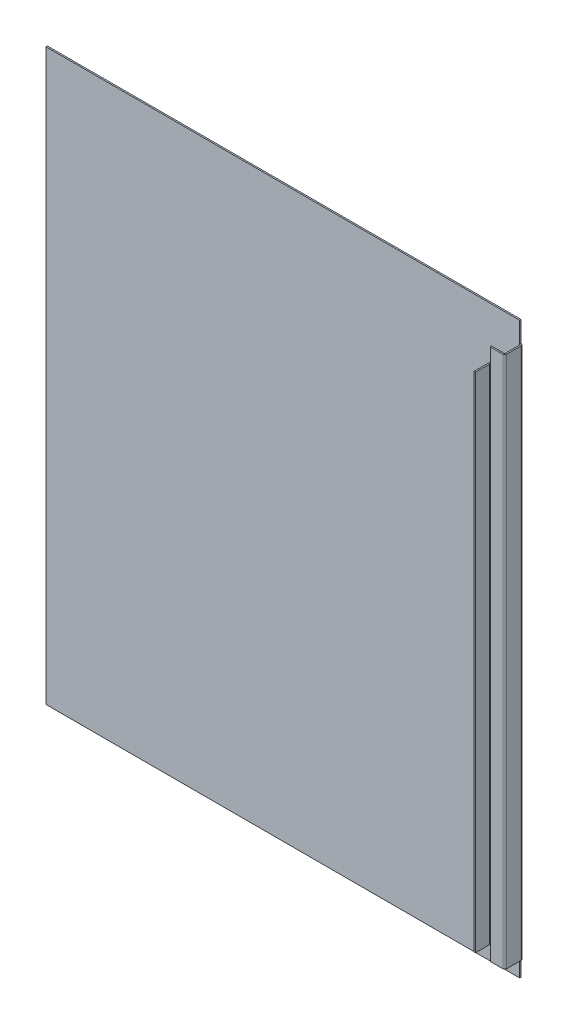
ISO-10303-21;
HEADER;
FILE_DESCRIPTION(('STEP AP214'),'2;1');
FILE_NAME('part.step','',(''),(''),'','','');
FILE_SCHEMA(('AUTOMOTIVE_DESIGN { 1 0 10303 214 1 1 1 1 }'));
ENDSEC;
DATA;
#1=APPLICATION_CONTEXT('core data for automotive mechanical design processes');
#2=APPLICATION_PROTOCOL_DEFINITION('international standard','automotive_design',2000,#1);
#3=PRODUCT_CONTEXT('',#1,'mechanical');
#4=PRODUCT('Part','Part','',(#3));
#5=PRODUCT_RELATED_PRODUCT_CATEGORY('part','',(#4));
#6=PRODUCT_DEFINITION_FORMATION('','',#4);
#7=PRODUCT_DEFINITION_CONTEXT('part definition',#1,'design');
#8=PRODUCT_DEFINITION('design','',#6,#7);
#9=PRODUCT_DEFINITION_SHAPE('','',#8);
#10=(LENGTH_UNIT() NAMED_UNIT(*) SI_UNIT(.MILLI.,.METRE.));
#11=(NAMED_UNIT(*) PLANE_ANGLE_UNIT() SI_UNIT($,.RADIAN.));
#12=(NAMED_UNIT(*) SI_UNIT($,.STERADIAN.) SOLID_ANGLE_UNIT());
#13=UNCERTAINTY_MEASURE_WITH_UNIT(LENGTH_MEASURE(1.E-05),#10,'distance_accuracy_value','');
#14=(GEOMETRIC_REPRESENTATION_CONTEXT(3) GLOBAL_UNCERTAINTY_ASSIGNED_CONTEXT((#13)) GLOBAL_UNIT_ASSIGNED_CONTEXT((#10,
#11,#12)) REPRESENTATION_CONTEXT('',''));
#15=CARTESIAN_POINT('',(0.,0.,0.));
#16=DIRECTION('',(0.,0.,1.));
#17=DIRECTION('',(1.,0.,0.));
#18=AXIS2_PLACEMENT_3D('',#15,#16,#17);
#19=CARTESIAN_POINT('',(302.15,776.2,25.));
#20=DIRECTION('',(1.,0.,0.));
#21=DIRECTION('',(0.,0.,-1.));
#22=AXIS2_PLACEMENT_3D('',#19,#20,#21);
#23=PLANE('',#22);
#24=DIRECTION('',(0.,0.,1.));
#25=VECTOR('',#24,1.);
#26=CARTESIAN_POINT('',(302.15,727.8,35.3683));
#27=LINE('',#26,#25);
#28=CARTESIAN_POINT('',(302.15,727.8,25.7366));
#29=VERTEX_POINT('',#28);
#30=CARTESIAN_POINT('',(302.15,727.8,45.));
#31=VERTEX_POINT('',#30);
#32=EDGE_CURVE('E199',#29,#31,#27,.T.);
#33=ORIENTED_EDGE('',*,*,#32,.F.);
#34=DIRECTION('',(0.,-1.,0.));
#35=VECTOR('',#34,1.);
#36=CARTESIAN_POINT('',(302.15,776.2,25.7366));
#37=LINE('',#36,#35);
#38=CARTESIAN_POINT('',(302.15,42.5,25.7366));
#39=VERTEX_POINT('',#38);
#40=EDGE_CURVE('E253',#29,#39,#37,.T.);
#41=ORIENTED_EDGE('',*,*,#40,.T.);
#42=DIRECTION('',(0.,0.,1.));
#43=VECTOR('',#42,1.);
#44=CARTESIAN_POINT('',(302.15,42.5,22.3634));
#45=LINE('',#44,#43);
#46=CARTESIAN_POINT('',(302.15,42.5,45.));
#47=VERTEX_POINT('',#46);
#48=EDGE_CURVE('E815',#39,#47,#45,.T.);
#49=ORIENTED_EDGE('',*,*,#48,.T.);
#50=DIRECTION('',(0.,-1.,0.));
#51=VECTOR('',#50,1.);
#52=CARTESIAN_POINT('',(302.15,776.2,45.));
#53=LINE('',#52,#51);
#54=EDGE_CURVE('E218',#31,#47,#53,.T.);
#55=ORIENTED_EDGE('',*,*,#54,.F.);
#56=EDGE_LOOP('',(#33,#41,#49,#55));
#57=FACE_BOUND('',#56,.T.);
#58=ADVANCED_FACE('F43',(#57),#23,.F.);
#59=CARTESIAN_POINT('',(304.05,776.2,45.));
#60=DIRECTION('',(0.,0.,1.));
#61=DIRECTION('',(1.,0.,0.));
#62=AXIS2_PLACEMENT_3D('',#59,#60,#61);
#63=PLANE('',#62);
#64=DIRECTION('',(0.,-1.,0.));
#65=VECTOR('',#64,1.);
#66=CARTESIAN_POINT('',(304.05,776.2,45.));
#67=LINE('',#66,#65);
#68=CARTESIAN_POINT('',(304.05,727.8,45.));
#69=VERTEX_POINT('',#68);
#70=CARTESIAN_POINT('',(304.05,42.5,45.));
#71=VERTEX_POINT('',#70);
#72=EDGE_CURVE('E211',#69,#71,#67,.T.);
#73=ORIENTED_EDGE('',*,*,#72,.F.);
#74=DIRECTION('',(-1.,0.,0.));
#75=VECTOR('',#74,1.);
#76=CARTESIAN_POINT('',(304.05,727.8,45.));
#77=LINE('',#76,#75);
#78=EDGE_CURVE('E193',#31,#69,#77,.F.);
#79=ORIENTED_EDGE('',*,*,#78,.F.);
#80=ORIENTED_EDGE('',*,*,#54,.T.);
#81=DIRECTION('',(1.,0.,0.));
#82=VECTOR('',#81,1.);
#83=CARTESIAN_POINT('',(302.15,42.5,45.));
#84=LINE('',#83,#82);
#85=EDGE_CURVE('E217',#71,#47,#84,.F.);
#86=ORIENTED_EDGE('',*,*,#85,.F.);
#87=EDGE_LOOP('',(#73,#79,#80,#86));
#88=FACE_BOUND('',#87,.T.);
#89=ADVANCED_FACE('F216',(#88),#63,.T.);
#90=CARTESIAN_POINT('',(304.05,776.2,25.));
#91=DIRECTION('',(1.,0.,0.));
#92=DIRECTION('',(0.,0.,-1.));
#93=AXIS2_PLACEMENT_3D('',#90,#91,#92);
#94=PLANE('',#93);
#95=DIRECTION('',(0.,-1.,0.));
#96=VECTOR('',#95,1.);
#97=CARTESIAN_POINT('',(304.05,776.2,25.7366));
#98=LINE('',#97,#96);
#99=CARTESIAN_POINT('',(304.05,727.8,25.7366));
#100=VERTEX_POINT('',#99);
#101=CARTESIAN_POINT('',(304.05,42.5,25.7366));
#102=VERTEX_POINT('',#101);
#103=EDGE_CURVE('E213',#100,#102,#98,.T.);
#104=ORIENTED_EDGE('',*,*,#103,.F.);
#105=DIRECTION('',(0.,0.,1.));
#106=VECTOR('',#105,1.);
#107=CARTESIAN_POINT('',(304.05,727.8,25.));
#108=LINE('',#107,#106);
#109=EDGE_CURVE('E196',#100,#69,#108,.T.);
#110=ORIENTED_EDGE('',*,*,#109,.T.);
#111=ORIENTED_EDGE('',*,*,#72,.T.);
#112=DIRECTION('',(0.,0.,-1.));
#113=VECTOR('',#112,1.);
#114=CARTESIAN_POINT('',(304.05,42.5,35.3683));
#115=LINE('',#114,#113);
#116=EDGE_CURVE('E439',#102,#71,#115,.F.);
#117=ORIENTED_EDGE('',*,*,#116,.F.);
#118=EDGE_LOOP('',(#104,#110,#111,#117));
#119=FACE_BOUND('',#118,.T.);
#120=ADVANCED_FACE('F209',(#119),#94,.T.);
#121=CARTESIAN_POINT('',(304.7866,776.2,25.7366));
#122=DIRECTION('',(0.,-1.,0.));
#123=DIRECTION('',(0.,0.,-1.));
#124=AXIS2_PLACEMENT_3D('',#121,#122,#123);
#125=CYLINDRICAL_SURFACE('',#124,0.7366);
#126=DIRECTION('',(0.,-1.,0.));
#127=VECTOR('',#126,1.);
#128=CARTESIAN_POINT('',(304.580812409922,776.2,25.0293298763769));
#129=LINE('',#128,#127);
#130=CARTESIAN_POINT('',(304.580812409922,747.8,25.0293298763769));
#131=VERTEX_POINT('',#130);
#132=CARTESIAN_POINT('',(304.580812409922,727.8,25.0293298763769));
#133=VERTEX_POINT('',#132);
#134=EDGE_CURVE('E58',#131,#133,#129,.T.);
#135=ORIENTED_EDGE('',*,*,#134,.T.);
#136=CARTESIAN_POINT('',(304.7866,727.8,25.7366));
#137=DIRECTION('',(0.,-1.,0.));
#138=DIRECTION('',(0.,0.,-1.));
#139=AXIS2_PLACEMENT_3D('',#136,#137,#138);
#140=CIRCLE('',#139,0.7366);
#141=EDGE_CURVE('E441',#100,#133,#140,.T.);
#142=ORIENTED_EDGE('',*,*,#141,.F.);
#143=ORIENTED_EDGE('',*,*,#103,.T.);
#144=CARTESIAN_POINT('',(304.7866,42.5,25.7366));
#145=DIRECTION('',(0.,-1.,0.));
#146=DIRECTION('',(0.,0.,-1.));
#147=AXIS2_PLACEMENT_3D('',#144,#145,#146);
#148=CIRCLE('',#147,0.7366);
#149=CARTESIAN_POINT('',(304.580812409922,42.5,25.0293298763769));
#150=VERTEX_POINT('',#149);
#151=EDGE_CURVE('E443',#150,#102,#148,.F.);
#152=ORIENTED_EDGE('',*,*,#151,.F.);
#153=DIRECTION('',(0.,-1.,0.));
#154=VECTOR('',#153,1.);
#155=CARTESIAN_POINT('',(304.580812409922,776.2,25.0293298763769));
#156=LINE('',#155,#154);
#157=CARTESIAN_POINT('',(304.580812409922,22.5,25.0293298763769));
#158=VERTEX_POINT('',#157);
#159=EDGE_CURVE('E306',#158,#150,#156,.F.);
#160=ORIENTED_EDGE('',*,*,#159,.F.);
#161=CARTESIAN_POINT('',(304.7866,22.5,25.7366));
#162=DIRECTION('',(0.,-1.,0.));
#163=DIRECTION('',(0.,0.,-1.));
#164=AXIS2_PLACEMENT_3D('',#161,#162,#163);
#165=CIRCLE('',#164,0.7366);
#166=CARTESIAN_POINT('',(304.7866,22.5,25.));
#167=VERTEX_POINT('',#166);
#168=EDGE_CURVE('E304',#167,#158,#165,.F.);
#169=ORIENTED_EDGE('',*,*,#168,.F.);
#170=DIRECTION('',(0.,-1.,0.));
#171=VECTOR('',#170,1.);
#172=CARTESIAN_POINT('',(304.7866,776.2,25.));
#173=LINE('',#172,#171);
#174=CARTESIAN_POINT('',(304.7866,747.8,25.));
#175=VERTEX_POINT('',#174);
#176=EDGE_CURVE('E221',#175,#167,#173,.T.);
#177=ORIENTED_EDGE('',*,*,#176,.F.);
#178=CARTESIAN_POINT('',(304.7866,747.8,25.7366));
#179=DIRECTION('',(0.,1.,0.));
#180=DIRECTION('',(0.,0.,1.));
#181=AXIS2_PLACEMENT_3D('',#178,#179,#180);
#182=CIRCLE('',#181,0.736599999999988);
#183=EDGE_CURVE('E301',#175,#131,#182,.T.);
#184=ORIENTED_EDGE('',*,*,#183,.T.);
#185=EDGE_LOOP('',(#135,#142,#143,#152,#160,#169,#177,#184));
#186=FACE_BOUND('',#185,.T.);
#187=ADVANCED_FACE('F300',(#186),#125,.F.);
#188=CARTESIAN_POINT('',(304.7866,776.2,25.7366));
#189=DIRECTION('',(0.,-1.,0.));
#190=DIRECTION('',(0.,0.,-1.));
#191=AXIS2_PLACEMENT_3D('',#188,#189,#190);
#192=CYLINDRICAL_SURFACE('',#191,2.6366);
#193=CARTESIAN_POINT('',(304.7866,727.8,25.7366));
#194=DIRECTION('',(0.,-1.,0.));
#195=DIRECTION('',(0.,0.,-1.));
#196=AXIS2_PLACEMENT_3D('',#193,#194,#195);
#197=CIRCLE('',#196,2.6366);
#198=CARTESIAN_POINT('',(304.05,727.8,23.2049839153616));
#199=VERTEX_POINT('',#198);
#200=EDGE_CURVE('E427',#29,#199,#197,.T.);
#201=ORIENTED_EDGE('',*,*,#200,.T.);
#202=DIRECTION('',(0.,-1.,0.));
#203=VECTOR('',#202,1.);
#204=CARTESIAN_POINT('',(304.05,776.2,23.2049839153616));
#205=LINE('',#204,#203);
#206=CARTESIAN_POINT('',(304.05,747.8,23.2049839153616));
#207=VERTEX_POINT('',#206);
#208=EDGE_CURVE('E204',#207,#199,#205,.T.);
#209=ORIENTED_EDGE('',*,*,#208,.F.);
#210=CARTESIAN_POINT('',(304.7866,747.8,25.7366));
#211=DIRECTION('',(0.,-1.,0.));
#212=DIRECTION('',(0.,0.,-1.));
#213=AXIS2_PLACEMENT_3D('',#210,#211,#212);
#214=CIRCLE('',#213,2.6366);
#215=CARTESIAN_POINT('',(304.7866,747.8,23.1));
#216=VERTEX_POINT('',#215);
#217=EDGE_CURVE('E360',#216,#207,#214,.F.);
#218=ORIENTED_EDGE('',*,*,#217,.F.);
#219=DIRECTION('',(0.,-1.,0.));
#220=VECTOR('',#219,1.);
#221=CARTESIAN_POINT('',(304.7866,776.2,23.1));
#222=LINE('',#221,#220);
#223=CARTESIAN_POINT('',(304.7866,22.5,23.1));
#224=VERTEX_POINT('',#223);
#225=EDGE_CURVE('E256',#216,#224,#222,.T.);
#226=ORIENTED_EDGE('',*,*,#225,.T.);
#227=CARTESIAN_POINT('',(304.7866,22.5,25.7366));
#228=DIRECTION('',(0.,1.,0.));
#229=DIRECTION('',(0.,0.,1.));
#230=AXIS2_PLACEMENT_3D('',#227,#228,#229);
#231=CIRCLE('',#230,2.6366);
#232=CARTESIAN_POINT('',(304.05,22.5,23.2049839153616));
#233=VERTEX_POINT('',#232);
#234=EDGE_CURVE('E310',#224,#233,#231,.T.);
#235=ORIENTED_EDGE('',*,*,#234,.T.);
#236=DIRECTION('',(0.,-1.,0.));
#237=VECTOR('',#236,1.);
#238=CARTESIAN_POINT('',(304.05,776.2,23.2049839153616));
#239=LINE('',#238,#237);
#240=CARTESIAN_POINT('',(304.05,42.5,23.2049839153616));
#241=VERTEX_POINT('',#240);
#242=EDGE_CURVE('E66',#233,#241,#239,.F.);
#243=ORIENTED_EDGE('',*,*,#242,.T.);
#244=CARTESIAN_POINT('',(304.7866,42.5,25.7366));
#245=DIRECTION('',(0.,1.,0.));
#246=DIRECTION('',(0.,0.,1.));
#247=AXIS2_PLACEMENT_3D('',#244,#245,#246);
#248=CIRCLE('',#247,2.6366);
#249=EDGE_CURVE('E444',#241,#39,#248,.T.);
#250=ORIENTED_EDGE('',*,*,#249,.T.);
#251=ORIENTED_EDGE('',*,*,#40,.F.);
#252=EDGE_LOOP('',(#201,#209,#218,#226,#235,#243,#250,#251));
#253=FACE_BOUND('',#252,.T.);
#254=ADVANCED_FACE('F424',(#253),#192,.T.);
#255=CARTESIAN_POINT('',(304.7866,747.8,25.7366));
#256=DIRECTION('',(0.,-1.,0.));
#257=DIRECTION('',(0.,0.,-1.));
#258=AXIS2_PLACEMENT_3D('',#255,#256,#257);
#259=PLANE('',#258);
#260=ORIENTED_EDGE('',*,*,#217,.T.);
#261=DIRECTION('',(-0.279374952590448,0.,-0.960182084744912));
#262=VECTOR('',#261,1.);
#263=CARTESIAN_POINT('',(304.05,747.8,23.2049839153616));
#264=LINE('',#263,#262);
#265=EDGE_CURVE('E437',#207,#131,#264,.F.);
#266=ORIENTED_EDGE('',*,*,#265,.T.);
#267=ORIENTED_EDGE('',*,*,#183,.F.);
#268=DIRECTION('',(0.,0.,-1.));
#269=VECTOR('',#268,1.);
#270=CARTESIAN_POINT('',(304.7866,747.8,25.));
#271=LINE('',#270,#269);
#272=EDGE_CURVE('E338',#175,#216,#271,.T.);
#273=ORIENTED_EDGE('',*,*,#272,.T.);
#274=EDGE_LOOP('',(#260,#266,#267,#273));
#275=FACE_BOUND('',#274,.T.);
#276=ADVANCED_FACE('F420',(#275),#259,.F.);
#277=CARTESIAN_POINT('',(304.7866,22.5,25.7366));
#278=DIRECTION('',(0.,-1.,0.));
#279=DIRECTION('',(0.,0.,-1.));
#280=AXIS2_PLACEMENT_3D('',#277,#278,#279);
#281=PLANE('',#280);
#282=ORIENTED_EDGE('',*,*,#168,.T.);
#283=DIRECTION('',(-0.279374952590448,0.,-0.960182084744912));
#284=VECTOR('',#283,1.);
#285=CARTESIAN_POINT('',(304.05,22.5,23.2049839153616));
#286=LINE('',#285,#284);
#287=EDGE_CURVE('E446',#233,#158,#286,.F.);
#288=ORIENTED_EDGE('',*,*,#287,.F.);
#289=ORIENTED_EDGE('',*,*,#234,.F.);
#290=DIRECTION('',(0.,0.,-1.));
#291=VECTOR('',#290,1.);
#292=CARTESIAN_POINT('',(304.7866,22.5,23.1));
#293=LINE('',#292,#291);
#294=EDGE_CURVE('E309',#224,#167,#293,.F.);
#295=ORIENTED_EDGE('',*,*,#294,.T.);
#296=EDGE_LOOP('',(#282,#288,#289,#295));
#297=FACE_BOUND('',#296,.T.);
#298=ADVANCED_FACE('F516',(#297),#281,.T.);
#299=CARTESIAN_POINT('',(324.05,776.2,25.));
#300=DIRECTION('',(0.,0.,1.));
#301=DIRECTION('',(1.,0.,0.));
#302=AXIS2_PLACEMENT_3D('',#299,#300,#301);
#303=PLANE('',#302);
#304=ORIENTED_EDGE('',*,*,#176,.T.);
#305=DIRECTION('',(1.,0.,0.));
#306=VECTOR('',#305,1.);
#307=CARTESIAN_POINT('',(324.05,22.5,25.));
#308=LINE('',#307,#306);
#309=CARTESIAN_POINT('',(321.4134,22.5,25.));
#310=VERTEX_POINT('',#309);
#311=EDGE_CURVE('E294',#167,#310,#308,.T.);
#312=ORIENTED_EDGE('',*,*,#311,.T.);
#313=DIRECTION('',(0.,-1.,0.));
#314=VECTOR('',#313,1.);
#315=CARTESIAN_POINT('',(321.4134,776.2,25.));
#316=LINE('',#315,#314);
#317=CARTESIAN_POINT('',(321.4134,747.8,25.));
#318=VERTEX_POINT('',#317);
#319=EDGE_CURVE('E285',#318,#310,#316,.T.);
#320=ORIENTED_EDGE('',*,*,#319,.F.);
#321=DIRECTION('',(1.,0.,0.));
#322=VECTOR('',#321,1.);
#323=CARTESIAN_POINT('',(313.1,747.8,25.));
#324=LINE('',#323,#322);
#325=EDGE_CURVE('E296',#175,#318,#324,.T.);
#326=ORIENTED_EDGE('',*,*,#325,.F.);
#327=EDGE_LOOP('',(#304,#312,#320,#326));
#328=FACE_BOUND('',#327,.T.);
#329=ADVANCED_FACE('F292',(#328),#303,.T.);
#330=CARTESIAN_POINT('',(321.4134,776.2,22.3634));
#331=DIRECTION('',(0.,-1.,0.));
#332=DIRECTION('',(0.,0.,-1.));
#333=AXIS2_PLACEMENT_3D('',#330,#331,#332);
#334=CYLINDRICAL_SURFACE('',#333,2.6366);
#335=ORIENTED_EDGE('',*,*,#319,.T.);
#336=CARTESIAN_POINT('',(321.4134,22.5,22.3634));
#337=DIRECTION('',(0.,1.,0.));
#338=DIRECTION('',(0.,0.,1.));
#339=AXIS2_PLACEMENT_3D('',#336,#337,#338);
#340=CIRCLE('',#339,2.63659999999999);
#341=CARTESIAN_POINT('',(324.05,22.5,22.3634));
#342=VERTEX_POINT('',#341);
#343=EDGE_CURVE('E318',#310,#342,#340,.T.);
#344=ORIENTED_EDGE('',*,*,#343,.T.);
#345=DIRECTION('',(0.,-1.,0.));
#346=VECTOR('',#345,1.);
#347=CARTESIAN_POINT('',(324.05,776.2,22.3634));
#348=LINE('',#347,#346);
#349=CARTESIAN_POINT('',(324.05,747.8,22.3634));
#350=VERTEX_POINT('',#349);
#351=EDGE_CURVE('E282',#350,#342,#348,.T.);
#352=ORIENTED_EDGE('',*,*,#351,.F.);
#353=CARTESIAN_POINT('',(321.4134,747.8,22.3634));
#354=DIRECTION('',(0.,-1.,0.));
#355=DIRECTION('',(0.,0.,-1.));
#356=AXIS2_PLACEMENT_3D('',#353,#354,#355);
#357=CIRCLE('',#356,2.63659999999999);
#358=EDGE_CURVE('E354',#350,#318,#357,.T.);
#359=ORIENTED_EDGE('',*,*,#358,.T.);
#360=EDGE_LOOP('',(#335,#344,#352,#359));
#361=FACE_BOUND('',#360,.T.);
#362=ADVANCED_FACE('F472',(#361),#334,.T.);
#363=CARTESIAN_POINT('',(324.05,776.2,0.));
#364=DIRECTION('',(1.,0.,0.));
#365=DIRECTION('',(0.,0.,-1.));
#366=AXIS2_PLACEMENT_3D('',#363,#364,#365);
#367=PLANE('',#366);
#368=ORIENTED_EDGE('',*,*,#351,.T.);
#369=DIRECTION('',(0.,0.,-1.));
#370=VECTOR('',#369,1.);
#371=CARTESIAN_POINT('',(324.05,22.5,0.));
#372=LINE('',#371,#370);
#373=CARTESIAN_POINT('',(324.05,22.5,2.6366));
#374=VERTEX_POINT('',#373);
#375=EDGE_CURVE('E315',#342,#374,#372,.T.);
#376=ORIENTED_EDGE('',*,*,#375,.T.);
#377=DIRECTION('',(0.,-1.,0.));
#378=VECTOR('',#377,1.);
#379=CARTESIAN_POINT('',(324.05,776.2,2.6366));
#380=LINE('',#379,#378);
#381=CARTESIAN_POINT('',(324.05,747.8,2.6366));
#382=VERTEX_POINT('',#381);
#383=EDGE_CURVE('E279',#382,#374,#380,.T.);
#384=ORIENTED_EDGE('',*,*,#383,.F.);
#385=DIRECTION('',(0.,0.,-1.));
#386=VECTOR('',#385,1.);
#387=CARTESIAN_POINT('',(324.05,747.8,12.5));
#388=LINE('',#387,#386);
#389=EDGE_CURVE('E339',#350,#382,#388,.T.);
#390=ORIENTED_EDGE('',*,*,#389,.F.);
#391=EDGE_LOOP('',(#368,#376,#384,#390));
#392=FACE_BOUND('',#391,.T.);
#393=ADVANCED_FACE('F474',(#392),#367,.T.);
#394=CARTESIAN_POINT('',(321.4134,776.2,2.6366));
#395=DIRECTION('',(0.,-1.,0.));
#396=DIRECTION('',(0.,0.,-1.));
#397=AXIS2_PLACEMENT_3D('',#394,#395,#396);
#398=CYLINDRICAL_SURFACE('',#397,2.6366);
#399=ORIENTED_EDGE('',*,*,#383,.T.);
#400=CARTESIAN_POINT('',(321.4134,22.5,2.6366));
#401=DIRECTION('',(0.,1.,0.));
#402=DIRECTION('',(0.,0.,1.));
#403=AXIS2_PLACEMENT_3D('',#400,#401,#402);
#404=CIRCLE('',#403,2.63659999999999);
#405=CARTESIAN_POINT('',(321.4134,22.5,0.));
#406=VERTEX_POINT('',#405);
#407=EDGE_CURVE('E332',#374,#406,#404,.T.);
#408=ORIENTED_EDGE('',*,*,#407,.T.);
#409=DIRECTION('',(0.,-1.,0.));
#410=VECTOR('',#409,1.);
#411=CARTESIAN_POINT('',(321.4134,776.2,0.));
#412=LINE('',#411,#410);
#413=CARTESIAN_POINT('',(321.4134,747.8,0.));
#414=VERTEX_POINT('',#413);
#415=EDGE_CURVE('E275',#414,#406,#412,.T.);
#416=ORIENTED_EDGE('',*,*,#415,.F.);
#417=CARTESIAN_POINT('',(321.4134,747.8,2.6366));
#418=DIRECTION('',(0.,-1.,0.));
#419=DIRECTION('',(0.,0.,-1.));
#420=AXIS2_PLACEMENT_3D('',#417,#418,#419);
#421=CIRCLE('',#420,2.63659999999999);
#422=EDGE_CURVE('E371',#414,#382,#421,.T.);
#423=ORIENTED_EDGE('',*,*,#422,.T.);
#424=EDGE_LOOP('',(#399,#408,#416,#423));
#425=FACE_BOUND('',#424,.T.);
#426=ADVANCED_FACE('F477',(#425),#398,.T.);
#427=CARTESIAN_POINT('',(321.4134,776.2,2.6366));
#428=DIRECTION('',(0.,-1.,0.));
#429=DIRECTION('',(0.,0.,-1.));
#430=AXIS2_PLACEMENT_3D('',#427,#428,#429);
#431=CYLINDRICAL_SURFACE('',#430,0.7366);
#432=CARTESIAN_POINT('',(321.4134,22.5,2.6366));
#433=DIRECTION('',(0.,-1.,0.));
#434=DIRECTION('',(0.,0.,-1.));
#435=AXIS2_PLACEMENT_3D('',#432,#433,#434);
#436=CIRCLE('',#435,0.7366);
#437=CARTESIAN_POINT('',(322.15,22.5,2.6366));
#438=VERTEX_POINT('',#437);
#439=CARTESIAN_POINT('',(321.4134,22.5,1.9));
#440=VERTEX_POINT('',#439);
#441=EDGE_CURVE('E330',#438,#440,#436,.F.);
#442=ORIENTED_EDGE('',*,*,#441,.F.);
#443=DIRECTION('',(0.,-1.,0.));
#444=VECTOR('',#443,1.);
#445=CARTESIAN_POINT('',(322.15,776.2,2.6366));
#446=LINE('',#445,#444);
#447=CARTESIAN_POINT('',(322.15,747.8,2.6366));
#448=VERTEX_POINT('',#447);
#449=EDGE_CURVE('E266',#448,#438,#446,.T.);
#450=ORIENTED_EDGE('',*,*,#449,.F.);
#451=CARTESIAN_POINT('',(321.4134,747.8,2.6366));
#452=DIRECTION('',(0.,-1.,0.));
#453=DIRECTION('',(0.,0.,-1.));
#454=AXIS2_PLACEMENT_3D('',#451,#452,#453);
#455=CIRCLE('',#454,0.7366);
#456=CARTESIAN_POINT('',(321.4134,747.8,1.9));
#457=VERTEX_POINT('',#456);
#458=EDGE_CURVE('E369',#457,#448,#455,.T.);
#459=ORIENTED_EDGE('',*,*,#458,.F.);
#460=DIRECTION('',(0.,-1.,0.));
#461=VECTOR('',#460,1.);
#462=CARTESIAN_POINT('',(321.4134,776.2,1.9));
#463=LINE('',#462,#461);
#464=EDGE_CURVE('E269',#457,#440,#463,.T.);
#465=ORIENTED_EDGE('',*,*,#464,.T.);
#466=EDGE_LOOP('',(#442,#450,#459,#465));
#467=FACE_BOUND('',#466,.T.);
#468=ADVANCED_FACE('F392',(#467),#431,.F.);
#469=CARTESIAN_POINT('',(322.15,776.2,0.));
#470=DIRECTION('',(1.,0.,0.));
#471=DIRECTION('',(0.,0.,-1.));
#472=AXIS2_PLACEMENT_3D('',#469,#470,#471);
#473=PLANE('',#472);
#474=DIRECTION('',(0.,0.,1.));
#475=VECTOR('',#474,1.);
#476=CARTESIAN_POINT('',(322.15,22.5,12.5));
#477=LINE('',#476,#475);
#478=CARTESIAN_POINT('',(322.15,22.5,22.3634));
#479=VERTEX_POINT('',#478);
#480=EDGE_CURVE('E397',#479,#438,#477,.F.);
#481=ORIENTED_EDGE('',*,*,#480,.F.);
#482=DIRECTION('',(0.,-1.,0.));
#483=VECTOR('',#482,1.);
#484=CARTESIAN_POINT('',(322.15,776.2,22.3634));
#485=LINE('',#484,#483);
#486=CARTESIAN_POINT('',(322.15,747.8,22.3634));
#487=VERTEX_POINT('',#486);
#488=EDGE_CURVE('E263',#487,#479,#485,.T.);
#489=ORIENTED_EDGE('',*,*,#488,.F.);
#490=DIRECTION('',(0.,0.,-1.));
#491=VECTOR('',#490,1.);
#492=CARTESIAN_POINT('',(322.15,747.8,1.9));
#493=LINE('',#492,#491);
#494=EDGE_CURVE('E335',#487,#448,#493,.T.);
#495=ORIENTED_EDGE('',*,*,#494,.T.);
#496=ORIENTED_EDGE('',*,*,#449,.T.);
#497=EDGE_LOOP('',(#481,#489,#495,#496));
#498=FACE_BOUND('',#497,.T.);
#499=ADVANCED_FACE('F395',(#498),#473,.F.);
#500=CARTESIAN_POINT('',(321.4134,776.2,22.3634));
#501=DIRECTION('',(0.,-1.,0.));
#502=DIRECTION('',(0.,0.,-1.));
#503=AXIS2_PLACEMENT_3D('',#500,#501,#502);
#504=CYLINDRICAL_SURFACE('',#503,0.7366);
#505=CARTESIAN_POINT('',(321.4134,22.5,22.3634));
#506=DIRECTION('',(0.,-1.,0.));
#507=DIRECTION('',(0.,0.,-1.));
#508=AXIS2_PLACEMENT_3D('',#505,#506,#507);
#509=CIRCLE('',#508,0.7366);
#510=CARTESIAN_POINT('',(321.4134,22.5,23.1));
#511=VERTEX_POINT('',#510);
#512=EDGE_CURVE('E409',#511,#479,#509,.F.);
#513=ORIENTED_EDGE('',*,*,#512,.F.);
#514=DIRECTION('',(0.,-1.,0.));
#515=VECTOR('',#514,1.);
#516=CARTESIAN_POINT('',(321.4134,776.2,23.1));
#517=LINE('',#516,#515);
#518=CARTESIAN_POINT('',(321.4134,747.8,23.1));
#519=VERTEX_POINT('',#518);
#520=EDGE_CURVE('E260',#519,#511,#517,.T.);
#521=ORIENTED_EDGE('',*,*,#520,.F.);
#522=CARTESIAN_POINT('',(321.4134,747.8,22.3634));
#523=DIRECTION('',(0.,-1.,0.));
#524=DIRECTION('',(0.,0.,-1.));
#525=AXIS2_PLACEMENT_3D('',#522,#523,#524);
#526=CIRCLE('',#525,0.7366);
#527=EDGE_CURVE('E352',#487,#519,#526,.T.);
#528=ORIENTED_EDGE('',*,*,#527,.F.);
#529=ORIENTED_EDGE('',*,*,#488,.T.);
#530=EDGE_LOOP('',(#513,#521,#528,#529));
#531=FACE_BOUND('',#530,.T.);
#532=ADVANCED_FACE('F408',(#531),#504,.F.);
#533=CARTESIAN_POINT('',(324.05,776.2,23.1));
#534=DIRECTION('',(0.,0.,1.));
#535=DIRECTION('',(1.,0.,0.));
#536=AXIS2_PLACEMENT_3D('',#533,#534,#535);
#537=PLANE('',#536);
#538=DIRECTION('',(-1.,0.,0.));
#539=VECTOR('',#538,1.);
#540=CARTESIAN_POINT('',(313.1,22.5,23.1));
#541=LINE('',#540,#539);
#542=EDGE_CURVE('E414',#224,#511,#541,.F.);
#543=ORIENTED_EDGE('',*,*,#542,.F.);
#544=ORIENTED_EDGE('',*,*,#225,.F.);
#545=DIRECTION('',(1.,0.,0.));
#546=VECTOR('',#545,1.);
#547=CARTESIAN_POINT('',(324.05,747.8,23.1));
#548=LINE('',#547,#546);
#549=EDGE_CURVE('E342',#216,#519,#548,.T.);
#550=ORIENTED_EDGE('',*,*,#549,.T.);
#551=ORIENTED_EDGE('',*,*,#520,.T.);
#552=EDGE_LOOP('',(#543,#544,#550,#551));
#553=FACE_BOUND('',#552,.T.);
#554=ADVANCED_FACE('F412',(#553),#537,.F.);
#555=CARTESIAN_POINT('',(322.15,0.,2.6366));
#556=DIRECTION('',(0.,-1.,0.));
#557=DIRECTION('',(0.,0.,-1.));
#558=AXIS2_PLACEMENT_3D('',#555,#556,#557);
#559=PLANE('',#558);
#560=DIRECTION('',(1.,0.,0.));
#561=VECTOR('',#560,1.);
#562=CARTESIAN_POINT('',(-324.05,0.,0.));
#563=LINE('',#562,#561);
#564=CARTESIAN_POINT('',(-324.05,0.,0.));
#565=VERTEX_POINT('',#564);
#566=CARTESIAN_POINT('',(321.4134,0.,0.));
#567=VERTEX_POINT('',#566);
#568=EDGE_CURVE('E233',#565,#567,#563,.T.);
#569=ORIENTED_EDGE('',*,*,#568,.T.);
#570=DIRECTION('',(0.,0.,1.));
#571=VECTOR('',#570,1.);
#572=CARTESIAN_POINT('',(321.4134,0.,0.));
#573=LINE('',#572,#571);
#574=CARTESIAN_POINT('',(321.4134,0.,1.9));
#575=VERTEX_POINT('',#574);
#576=EDGE_CURVE('E51',#567,#575,#573,.T.);
#577=ORIENTED_EDGE('',*,*,#576,.T.);
#578=DIRECTION('',(1.,0.,0.));
#579=VECTOR('',#578,1.);
#580=CARTESIAN_POINT('',(-324.05,0.,1.9));
#581=LINE('',#580,#579);
#582=CARTESIAN_POINT('',(-324.05,0.,1.9));
#583=VERTEX_POINT('',#582);
#584=EDGE_CURVE('E230',#583,#575,#581,.T.);
#585=ORIENTED_EDGE('',*,*,#584,.F.);
#586=DIRECTION('',(0.,0.,-1.));
#587=VECTOR('',#586,1.);
#588=CARTESIAN_POINT('',(-324.05,0.,1.9));
#589=LINE('',#588,#587);
#590=EDGE_CURVE('E245',#583,#565,#589,.T.);
#591=ORIENTED_EDGE('',*,*,#590,.T.);
#592=EDGE_LOOP('',(#569,#577,#585,#591));
#593=FACE_BOUND('',#592,.T.);
#594=ADVANCED_FACE('F45',(#593),#559,.T.);
#595=CARTESIAN_POINT('',(-324.05,776.2,0.));
#596=DIRECTION('',(0.,0.,-1.));
#597=DIRECTION('',(-1.,0.,0.));
#598=AXIS2_PLACEMENT_3D('',#595,#596,#597);
#599=PLANE('',#598);
#600=ORIENTED_EDGE('',*,*,#568,.F.);
#601=DIRECTION('',(0.,-1.,0.));
#602=VECTOR('',#601,1.);
#603=CARTESIAN_POINT('',(-324.05,776.2,0.));
#604=LINE('',#603,#602);
#605=CARTESIAN_POINT('',(-324.05,776.2,0.));
#606=VERTEX_POINT('',#605);
#607=EDGE_CURVE('E273',#606,#565,#604,.T.);
#608=ORIENTED_EDGE('',*,*,#607,.F.);
#609=DIRECTION('',(1.,0.,0.));
#610=VECTOR('',#609,1.);
#611=CARTESIAN_POINT('',(-324.05,776.2,0.));
#612=LINE('',#611,#610);
#613=CARTESIAN_POINT('',(321.4134,776.2,0.));
#614=VERTEX_POINT('',#613);
#615=EDGE_CURVE('E244',#606,#614,#612,.T.);
#616=ORIENTED_EDGE('',*,*,#615,.T.);
#617=EDGE_CURVE('E276',#614,#414,#412,.T.);
#618=ORIENTED_EDGE('',*,*,#617,.T.);
#619=ORIENTED_EDGE('',*,*,#415,.T.);
#620=DIRECTION('',(0.,-1.,0.));
#621=VECTOR('',#620,1.);
#622=CARTESIAN_POINT('',(321.4134,776.2,0.));
#623=LINE('',#622,#621);
#624=EDGE_CURVE('E325',#406,#567,#623,.T.);
#625=ORIENTED_EDGE('',*,*,#624,.T.);
#626=EDGE_LOOP('',(#600,#608,#616,#618,#619,#625));
#627=FACE_BOUND('',#626,.T.);
#628=ADVANCED_FACE('F480',(#627),#599,.T.);
#629=CARTESIAN_POINT('',(-324.05,776.2,1.9));
#630=DIRECTION('',(-1.,0.,0.));
#631=DIRECTION('',(0.,0.,1.));
#632=AXIS2_PLACEMENT_3D('',#629,#630,#631);
#633=PLANE('',#632);
#634=ORIENTED_EDGE('',*,*,#590,.F.);
#635=DIRECTION('',(0.,-1.,0.));
#636=VECTOR('',#635,1.);
#637=CARTESIAN_POINT('',(-324.05,776.2,1.9));
#638=LINE('',#637,#636);
#639=CARTESIAN_POINT('',(-324.05,776.2,1.9));
#640=VERTEX_POINT('',#639);
#641=EDGE_CURVE('E243',#640,#583,#638,.T.);
#642=ORIENTED_EDGE('',*,*,#641,.F.);
#643=DIRECTION('',(0.,0.,-1.));
#644=VECTOR('',#643,1.);
#645=CARTESIAN_POINT('',(-324.05,776.2,1.9));
#646=LINE('',#645,#644);
#647=EDGE_CURVE('E248',#640,#606,#646,.T.);
#648=ORIENTED_EDGE('',*,*,#647,.T.);
#649=ORIENTED_EDGE('',*,*,#607,.T.);
#650=EDGE_LOOP('',(#634,#642,#648,#649));
#651=FACE_BOUND('',#650,.T.);
#652=ADVANCED_FACE('F482',(#651),#633,.T.);
#653=CARTESIAN_POINT('',(-324.05,776.2,1.9));
#654=DIRECTION('',(0.,0.,-1.));
#655=DIRECTION('',(-1.,0.,0.));
#656=AXIS2_PLACEMENT_3D('',#653,#654,#655);
#657=PLANE('',#656);
#658=ORIENTED_EDGE('',*,*,#584,.T.);
#659=DIRECTION('',(0.,-1.,0.));
#660=VECTOR('',#659,1.);
#661=CARTESIAN_POINT('',(321.4134,776.2,1.9));
#662=LINE('',#661,#660);
#663=EDGE_CURVE('E240',#440,#575,#662,.T.);
#664=ORIENTED_EDGE('',*,*,#663,.F.);
#665=ORIENTED_EDGE('',*,*,#464,.F.);
#666=CARTESIAN_POINT('',(321.4134,776.2,1.9));
#667=VERTEX_POINT('',#666);
#668=EDGE_CURVE('E270',#667,#457,#463,.T.);
#669=ORIENTED_EDGE('',*,*,#668,.F.);
#670=DIRECTION('',(1.,0.,0.));
#671=VECTOR('',#670,1.);
#672=CARTESIAN_POINT('',(-324.05,776.2,1.9));
#673=LINE('',#672,#671);
#674=EDGE_CURVE('E257',#640,#667,#673,.T.);
#675=ORIENTED_EDGE('',*,*,#674,.F.);
#676=ORIENTED_EDGE('',*,*,#641,.T.);
#677=EDGE_LOOP('',(#658,#664,#665,#669,#675,#676));
#678=FACE_BOUND('',#677,.T.);
#679=ADVANCED_FACE('F238',(#678),#657,.F.);
#680=CARTESIAN_POINT('',(304.7866,776.2,25.7366));
#681=DIRECTION('',(0.,-1.,0.));
#682=DIRECTION('',(-1.,0.,0.));
#683=AXIS2_PLACEMENT_3D('',#680,#681,#682);
#684=PLANE('',#683);
#685=ORIENTED_EDGE('',*,*,#674,.T.);
#686=DIRECTION('',(0.,0.,-1.));
#687=VECTOR('',#686,1.);
#688=CARTESIAN_POINT('',(321.4134,776.2,1.9));
#689=LINE('',#688,#687);
#690=EDGE_CURVE('E11',#667,#614,#689,.T.);
#691=ORIENTED_EDGE('',*,*,#690,.T.);
#692=ORIENTED_EDGE('',*,*,#615,.F.);
#693=ORIENTED_EDGE('',*,*,#647,.F.);
#694=EDGE_LOOP('',(#685,#691,#692,#693));
#695=FACE_BOUND('',#694,.T.);
#696=ADVANCED_FACE('F380',(#695),#684,.F.);
#697=CARTESIAN_POINT('',(321.4134,747.8,2.6366));
#698=DIRECTION('',(0.,1.,0.));
#699=DIRECTION('',(0.,0.,1.));
#700=AXIS2_PLACEMENT_3D('',#697,#698,#699);
#701=PLANE('',#700);
#702=DIRECTION('',(0.,0.,-1.));
#703=VECTOR('',#702,1.);
#704=CARTESIAN_POINT('',(321.4134,747.8,1.9));
#705=LINE('',#704,#703);
#706=EDGE_CURVE('E366',#457,#414,#705,.T.);
#707=ORIENTED_EDGE('',*,*,#706,.F.);
#708=ORIENTED_EDGE('',*,*,#458,.T.);
#709=DIRECTION('',(-1.,0.,0.));
#710=VECTOR('',#709,1.);
#711=CARTESIAN_POINT('',(324.05,747.8,2.63659999999999));
#712=LINE('',#711,#710);
#713=EDGE_CURVE('E357',#382,#448,#712,.T.);
#714=ORIENTED_EDGE('',*,*,#713,.F.);
#715=ORIENTED_EDGE('',*,*,#422,.F.);
#716=EDGE_LOOP('',(#707,#708,#714,#715));
#717=FACE_BOUND('',#716,.T.);
#718=ADVANCED_FACE('F388',(#717),#701,.T.);
#719=CARTESIAN_POINT('',(321.4134,762.,1.9));
#720=DIRECTION('',(1.,0.,0.));
#721=DIRECTION('',(0.,-1.,0.));
#722=AXIS2_PLACEMENT_3D('',#719,#720,#721);
#723=PLANE('',#722);
#724=ORIENTED_EDGE('',*,*,#690,.F.);
#725=ORIENTED_EDGE('',*,*,#668,.T.);
#726=ORIENTED_EDGE('',*,*,#706,.T.);
#727=ORIENTED_EDGE('',*,*,#617,.F.);
#728=EDGE_LOOP('',(#724,#725,#726,#727));
#729=FACE_BOUND('',#728,.T.);
#730=ADVANCED_FACE('F384',(#729),#723,.T.);
#731=CARTESIAN_POINT('',(324.05,747.8,23.1));
#732=DIRECTION('',(0.,-1.,0.));
#733=DIRECTION('',(1.,0.,0.));
#734=AXIS2_PLACEMENT_3D('',#731,#732,#733);
#735=PLANE('',#734);
#736=ORIENTED_EDGE('',*,*,#325,.T.);
#737=DIRECTION('',(0.,0.,-1.));
#738=VECTOR('',#737,1.);
#739=CARTESIAN_POINT('',(321.4134,747.8,25.));
#740=LINE('',#739,#738);
#741=EDGE_CURVE('E346',#318,#519,#740,.T.);
#742=ORIENTED_EDGE('',*,*,#741,.T.);
#743=ORIENTED_EDGE('',*,*,#549,.F.);
#744=ORIENTED_EDGE('',*,*,#272,.F.);
#745=EDGE_LOOP('',(#736,#742,#743,#744));
#746=FACE_BOUND('',#745,.T.);
#747=ADVANCED_FACE('F417',(#746),#735,.F.);
#748=CARTESIAN_POINT('',(321.4134,747.8,22.3634));
#749=DIRECTION('',(0.,1.,0.));
#750=DIRECTION('',(0.,0.,1.));
#751=AXIS2_PLACEMENT_3D('',#748,#749,#750);
#752=PLANE('',#751);
#753=ORIENTED_EDGE('',*,*,#527,.T.);
#754=ORIENTED_EDGE('',*,*,#741,.F.);
#755=ORIENTED_EDGE('',*,*,#358,.F.);
#756=DIRECTION('',(-1.,0.,0.));
#757=VECTOR('',#756,1.);
#758=CARTESIAN_POINT('',(324.05,747.8,22.3634));
#759=LINE('',#758,#757);
#760=EDGE_CURVE('E349',#350,#487,#759,.T.);
#761=ORIENTED_EDGE('',*,*,#760,.T.);
#762=EDGE_LOOP('',(#753,#754,#755,#761));
#763=FACE_BOUND('',#762,.T.);
#764=ADVANCED_FACE('F403',(#763),#752,.T.);
#765=CARTESIAN_POINT('',(322.15,747.8,1.9));
#766=DIRECTION('',(0.,-1.,0.));
#767=DIRECTION('',(0.,0.,-1.));
#768=AXIS2_PLACEMENT_3D('',#765,#766,#767);
#769=PLANE('',#768);
#770=ORIENTED_EDGE('',*,*,#389,.T.);
#771=ORIENTED_EDGE('',*,*,#713,.T.);
#772=ORIENTED_EDGE('',*,*,#494,.F.);
#773=ORIENTED_EDGE('',*,*,#760,.F.);
#774=EDGE_LOOP('',(#770,#771,#772,#773));
#775=FACE_BOUND('',#774,.T.);
#776=ADVANCED_FACE('F399',(#775),#769,.F.);
#777=CARTESIAN_POINT('',(321.4134,22.5,2.6366));
#778=DIRECTION('',(0.,-1.,0.));
#779=DIRECTION('',(0.,0.,-1.));
#780=AXIS2_PLACEMENT_3D('',#777,#778,#779);
#781=PLANE('',#780);
#782=DIRECTION('',(-1.,0.,0.));
#783=VECTOR('',#782,1.);
#784=CARTESIAN_POINT('',(324.05,22.5,2.63659999999999));
#785=LINE('',#784,#783);
#786=EDGE_CURVE('E321',#374,#438,#785,.T.);
#787=ORIENTED_EDGE('',*,*,#786,.T.);
#788=ORIENTED_EDGE('',*,*,#441,.T.);
#789=DIRECTION('',(0.,0.,-1.));
#790=VECTOR('',#789,1.);
#791=CARTESIAN_POINT('',(321.4134,22.5,1.9));
#792=LINE('',#791,#790);
#793=EDGE_CURVE('E327',#440,#406,#792,.T.);
#794=ORIENTED_EDGE('',*,*,#793,.T.);
#795=ORIENTED_EDGE('',*,*,#407,.F.);
#796=EDGE_LOOP('',(#787,#788,#794,#795));
#797=FACE_BOUND('',#796,.T.);
#798=ADVANCED_FACE('F486',(#797),#781,.T.);
#799=CARTESIAN_POINT('',(321.4134,11.25,1.9));
#800=DIRECTION('',(1.,0.,0.));
#801=DIRECTION('',(0.,-1.,0.));
#802=AXIS2_PLACEMENT_3D('',#799,#800,#801);
#803=PLANE('',#802);
#804=ORIENTED_EDGE('',*,*,#663,.T.);
#805=ORIENTED_EDGE('',*,*,#576,.F.);
#806=ORIENTED_EDGE('',*,*,#624,.F.);
#807=ORIENTED_EDGE('',*,*,#793,.F.);
#808=EDGE_LOOP('',(#804,#805,#806,#807));
#809=FACE_BOUND('',#808,.T.);
#810=ADVANCED_FACE('F484',(#809),#803,.T.);
#811=CARTESIAN_POINT('',(324.05,22.5,0.));
#812=DIRECTION('',(0.,1.,0.));
#813=DIRECTION('',(0.,0.,-1.));
#814=AXIS2_PLACEMENT_3D('',#811,#812,#813);
#815=PLANE('',#814);
#816=DIRECTION('',(1.,0.,0.));
#817=VECTOR('',#816,1.);
#818=CARTESIAN_POINT('',(322.15,22.5,22.3634));
#819=LINE('',#818,#817);
#820=EDGE_CURVE('E464',#479,#342,#819,.T.);
#821=ORIENTED_EDGE('',*,*,#820,.F.);
#822=ORIENTED_EDGE('',*,*,#480,.T.);
#823=ORIENTED_EDGE('',*,*,#786,.F.);
#824=ORIENTED_EDGE('',*,*,#375,.F.);
#825=EDGE_LOOP('',(#821,#822,#823,#824));
#826=FACE_BOUND('',#825,.T.);
#827=ADVANCED_FACE('F489',(#826),#815,.F.);
#828=CARTESIAN_POINT('',(321.4134,22.5,22.3634));
#829=DIRECTION('',(0.,-1.,0.));
#830=DIRECTION('',(0.,0.,-1.));
#831=AXIS2_PLACEMENT_3D('',#828,#829,#830);
#832=PLANE('',#831);
#833=ORIENTED_EDGE('',*,*,#512,.T.);
#834=ORIENTED_EDGE('',*,*,#820,.T.);
#835=ORIENTED_EDGE('',*,*,#343,.F.);
#836=DIRECTION('',(0.,0.,1.));
#837=VECTOR('',#836,1.);
#838=CARTESIAN_POINT('',(321.4134,22.5,23.1));
#839=LINE('',#838,#837);
#840=EDGE_CURVE('E312',#511,#310,#839,.T.);
#841=ORIENTED_EDGE('',*,*,#840,.F.);
#842=EDGE_LOOP('',(#833,#834,#835,#841));
#843=FACE_BOUND('',#842,.T.);
#844=ADVANCED_FACE('F490',(#843),#832,.T.);
#845=CARTESIAN_POINT('',(324.05,22.5,25.));
#846=DIRECTION('',(0.,1.,0.));
#847=DIRECTION('',(1.,0.,0.));
#848=AXIS2_PLACEMENT_3D('',#845,#846,#847);
#849=PLANE('',#848);
#850=ORIENTED_EDGE('',*,*,#294,.F.);
#851=ORIENTED_EDGE('',*,*,#542,.T.);
#852=ORIENTED_EDGE('',*,*,#840,.T.);
#853=ORIENTED_EDGE('',*,*,#311,.F.);
#854=EDGE_LOOP('',(#850,#851,#852,#853));
#855=FACE_BOUND('',#854,.T.);
#856=ADVANCED_FACE('F492',(#855),#849,.F.);
#857=CARTESIAN_POINT('',(304.7866,42.5,25.7366));
#858=DIRECTION('',(0.,-1.,0.));
#859=DIRECTION('',(0.,0.,-1.));
#860=AXIS2_PLACEMENT_3D('',#857,#858,#859);
#861=PLANE('',#860);
#862=DIRECTION('',(-1.,0.,0.));
#863=VECTOR('',#862,1.);
#864=CARTESIAN_POINT('',(302.15,42.5,25.7366));
#865=LINE('',#864,#863);
#866=EDGE_CURVE('E453',#39,#102,#865,.F.);
#867=ORIENTED_EDGE('',*,*,#866,.F.);
#868=ORIENTED_EDGE('',*,*,#249,.F.);
#869=DIRECTION('',(-0.279374952590448,0.,-0.960182084744912));
#870=VECTOR('',#869,1.);
#871=CARTESIAN_POINT('',(304.05,42.5,23.2049839153616));
#872=LINE('',#871,#870);
#873=EDGE_CURVE('E450',#241,#150,#872,.F.);
#874=ORIENTED_EDGE('',*,*,#873,.T.);
#875=ORIENTED_EDGE('',*,*,#151,.T.);
#876=EDGE_LOOP('',(#867,#868,#874,#875));
#877=FACE_BOUND('',#876,.T.);
#878=ADVANCED_FACE('F498',(#877),#861,.T.);
#879=CARTESIAN_POINT('',(304.05,32.5,23.2049839153616));
#880=DIRECTION('',(0.960182084744912,0.,-0.279374952590448));
#881=DIRECTION('',(0.,-1.,0.));
#882=AXIS2_PLACEMENT_3D('',#879,#880,#881);
#883=PLANE('',#882);
#884=ORIENTED_EDGE('',*,*,#873,.F.);
#885=ORIENTED_EDGE('',*,*,#242,.F.);
#886=ORIENTED_EDGE('',*,*,#287,.T.);
#887=ORIENTED_EDGE('',*,*,#159,.T.);
#888=EDGE_LOOP('',(#884,#885,#886,#887));
#889=FACE_BOUND('',#888,.T.);
#890=ADVANCED_FACE('F728',(#889),#883,.F.);
#891=CARTESIAN_POINT('',(302.15,42.5,22.3634));
#892=DIRECTION('',(0.,1.,0.));
#893=DIRECTION('',(0.,0.,1.));
#894=AXIS2_PLACEMENT_3D('',#891,#892,#893);
#895=PLANE('',#894);
#896=ORIENTED_EDGE('',*,*,#866,.T.);
#897=ORIENTED_EDGE('',*,*,#116,.T.);
#898=ORIENTED_EDGE('',*,*,#85,.T.);
#899=ORIENTED_EDGE('',*,*,#48,.F.);
#900=EDGE_LOOP('',(#896,#897,#898,#899));
#901=FACE_BOUND('',#900,.T.);
#902=ADVANCED_FACE('F736',(#901),#895,.F.);
#903=CARTESIAN_POINT('',(304.7866,727.8,25.7366));
#904=DIRECTION('',(0.,1.,0.));
#905=DIRECTION('',(0.,0.,1.));
#906=AXIS2_PLACEMENT_3D('',#903,#904,#905);
#907=PLANE('',#906);
#908=DIRECTION('',(-0.279374952590448,0.,-0.960182084744912));
#909=VECTOR('',#908,1.);
#910=CARTESIAN_POINT('',(304.05,727.8,23.2049839153616));
#911=LINE('',#910,#909);
#912=EDGE_CURVE('E436',#199,#133,#911,.F.);
#913=ORIENTED_EDGE('',*,*,#912,.F.);
#914=ORIENTED_EDGE('',*,*,#200,.F.);
#915=DIRECTION('',(-1.,0.,0.));
#916=VECTOR('',#915,1.);
#917=CARTESIAN_POINT('',(302.15,727.8,25.7366));
#918=LINE('',#917,#916);
#919=EDGE_CURVE('E434',#29,#100,#918,.F.);
#920=ORIENTED_EDGE('',*,*,#919,.T.);
#921=ORIENTED_EDGE('',*,*,#141,.T.);
#922=EDGE_LOOP('',(#913,#914,#920,#921));
#923=FACE_BOUND('',#922,.T.);
#924=ADVANCED_FACE('F744',(#923),#907,.T.);
#925=CARTESIAN_POINT('',(304.05,737.8,23.2049839153616));
#926=DIRECTION('',(0.960182084744912,0.,-0.279374952590448));
#927=DIRECTION('',(0.,-1.,0.));
#928=AXIS2_PLACEMENT_3D('',#925,#926,#927);
#929=PLANE('',#928);
#930=ORIENTED_EDGE('',*,*,#208,.T.);
#931=ORIENTED_EDGE('',*,*,#912,.T.);
#932=ORIENTED_EDGE('',*,*,#134,.F.);
#933=ORIENTED_EDGE('',*,*,#265,.F.);
#934=EDGE_LOOP('',(#930,#931,#932,#933));
#935=FACE_BOUND('',#934,.T.);
#936=ADVANCED_FACE('F753',(#935),#929,.F.);
#937=CARTESIAN_POINT('',(304.05,727.8,25.));
#938=DIRECTION('',(0.,-1.,0.));
#939=DIRECTION('',(0.,0.,1.));
#940=AXIS2_PLACEMENT_3D('',#937,#938,#939);
#941=PLANE('',#940);
#942=ORIENTED_EDGE('',*,*,#919,.F.);
#943=ORIENTED_EDGE('',*,*,#32,.T.);
#944=ORIENTED_EDGE('',*,*,#78,.T.);
#945=ORIENTED_EDGE('',*,*,#109,.F.);
#946=EDGE_LOOP('',(#942,#943,#944,#945));
#947=FACE_BOUND('',#946,.T.);
#948=ADVANCED_FACE('F195',(#947),#941,.F.);
#949=CLOSED_SHELL('',(#58,#89,#120,#187,#254,#276,#298,#329,#362,#393,#426,#468,#499,#532,#554,
#594,#628,#652,#679,#696,#718,#730,#747,#764,#776,#798,#810,#827,#844,#856,#878,#890,#902,#924,
#936,#948));
#950=MANIFOLD_SOLID_BREP('B2',#949);
#951=ADVANCED_BREP_SHAPE_REPRESENTATION('',(#18,#950),#14);
#952=SHAPE_DEFINITION_REPRESENTATION(#9,#951);
ENDSEC;
END-ISO-10303-21;
